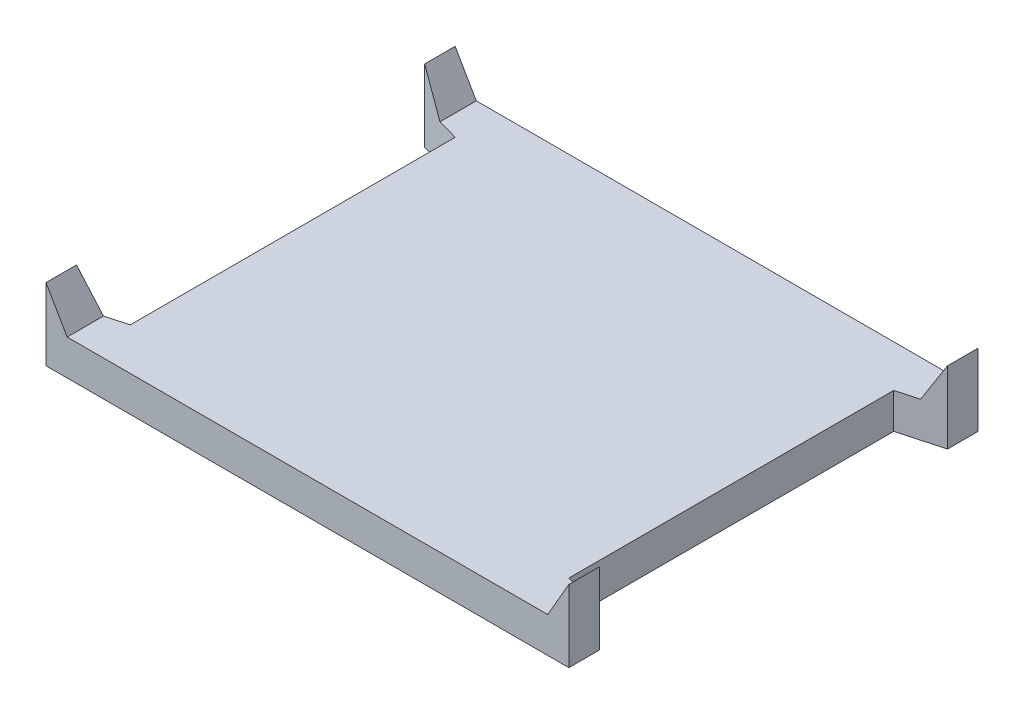
ISO-10303-21;
HEADER;
FILE_DESCRIPTION(('STEP AP214'),'2;1');
FILE_NAME('part.step','',(''),(''),'','','');
FILE_SCHEMA(('AUTOMOTIVE_DESIGN { 1 0 10303 214 1 1 1 1 }'));
ENDSEC;
DATA;
#1=APPLICATION_CONTEXT('core data for automotive mechanical design processes');
#2=APPLICATION_PROTOCOL_DEFINITION('international standard','automotive_design',2000,#1);
#3=PRODUCT_CONTEXT('',#1,'mechanical');
#4=PRODUCT('Part','Part','',(#3));
#5=PRODUCT_RELATED_PRODUCT_CATEGORY('part','',(#4));
#6=PRODUCT_DEFINITION_FORMATION('','',#4);
#7=PRODUCT_DEFINITION_CONTEXT('part definition',#1,'design');
#8=PRODUCT_DEFINITION('design','',#6,#7);
#9=PRODUCT_DEFINITION_SHAPE('','',#8);
#10=(LENGTH_UNIT() NAMED_UNIT(*) SI_UNIT(.MILLI.,.METRE.));
#11=(NAMED_UNIT(*) PLANE_ANGLE_UNIT() SI_UNIT($,.RADIAN.));
#12=(NAMED_UNIT(*) SI_UNIT($,.STERADIAN.) SOLID_ANGLE_UNIT());
#13=UNCERTAINTY_MEASURE_WITH_UNIT(LENGTH_MEASURE(1.E-05),#10,'distance_accuracy_value','');
#14=(GEOMETRIC_REPRESENTATION_CONTEXT(3) GLOBAL_UNCERTAINTY_ASSIGNED_CONTEXT((#13)) GLOBAL_UNIT_ASSIGNED_CONTEXT((#10,
#11,#12)) REPRESENTATION_CONTEXT('',''));
#15=CARTESIAN_POINT('',(0.,0.,0.));
#16=DIRECTION('',(0.,0.,1.));
#17=DIRECTION('',(1.,0.,0.));
#18=AXIS2_PLACEMENT_3D('',#15,#16,#17);
#19=CARTESIAN_POINT('',(1.118652877862,0.15,-0.5588));
#20=DIRECTION('',(0.866025403784329,-0.50000000000019,0.));
#21=DIRECTION('',(0.50000000000019,0.866025403784329,0.));
#22=AXIS2_PLACEMENT_3D('',#19,#20,#21);
#23=PLANE('',#22);
#24=DIRECTION('',(0.500000000001896,0.866025403783344,0.));
#25=VECTOR('',#24,1.);
#26=CARTESIAN_POINT('',(1.016,-0.02779999999999,-0.865));
#27=LINE('',#26,#25);
#28=CARTESIAN_POINT('',(1.01600000000001,-0.0277999999999941,-0.865));
#29=VERTEX_POINT('',#28);
#30=CARTESIAN_POINT('',(1.10537382167086,0.12700000000008,-0.865));
#31=VERTEX_POINT('',#30);
#32=EDGE_CURVE('E168',#29,#31,#27,.T.);
#33=ORIENTED_EDGE('',*,*,#32,.F.);
#34=DIRECTION('',(0.,0.,1.));
#35=VECTOR('',#34,1.);
#36=CARTESIAN_POINT('',(1.016,-0.02779999999999,0.));
#37=LINE('',#36,#35);
#38=CARTESIAN_POINT('',(1.01599999999999,-0.0277999999999983,-0.711432590348084));
#39=VERTEX_POINT('',#38);
#40=EDGE_CURVE('E20',#39,#29,#37,.F.);
#41=ORIENTED_EDGE('',*,*,#40,.F.);
#42=DIRECTION('',(-0.495345023716674,-0.857962748349385,0.136136805911909));
#43=VECTOR('',#42,1.);
#44=CARTESIAN_POINT('',(1.1053738216709,0.127,-0.735995402190348));
#45=LINE('',#44,#43);
#46=CARTESIAN_POINT('',(1.10537382167088,0.12700000000004,-0.735995402190174));
#47=VERTEX_POINT('',#46);
#48=EDGE_CURVE('E190',#47,#39,#45,.T.);
#49=ORIENTED_EDGE('',*,*,#48,.F.);
#50=DIRECTION('',(0.,0.,1.));
#51=VECTOR('',#50,1.);
#52=CARTESIAN_POINT('',(1.105373821671,0.127,0.865));
#53=LINE('',#52,#51);
#54=EDGE_CURVE('E174',#47,#31,#53,.F.);
#55=ORIENTED_EDGE('',*,*,#54,.T.);
#56=EDGE_LOOP('',(#33,#41,#49,#55));
#57=FACE_BOUND('',#56,.T.);
#58=ADVANCED_FACE('F17',(#57),#23,.F.);
#59=CARTESIAN_POINT('',(-1.118652877862,0.15,-0.5588));
#60=DIRECTION('',(0.866025403784329,0.50000000000019,0.));
#61=DIRECTION('',(-0.50000000000019,0.866025403784329,0.));
#62=AXIS2_PLACEMENT_3D('',#59,#60,#61);
#63=PLANE('',#62);
#64=DIRECTION('',(0.,0.,-1.));
#65=VECTOR('',#64,1.);
#66=CARTESIAN_POINT('',(-1.105373821671,0.127,-0.865));
#67=LINE('',#66,#65);
#68=CARTESIAN_POINT('',(-1.10537382167093,0.12700000000004,-0.865));
#69=VERTEX_POINT('',#68);
#70=CARTESIAN_POINT('',(-1.10537382167091,0.12700000000004,-0.735995402190087));
#71=VERTEX_POINT('',#70);
#72=EDGE_CURVE('E247',#69,#71,#67,.F.);
#73=ORIENTED_EDGE('',*,*,#72,.T.);
#74=DIRECTION('',(0.495345023716674,-0.857962748349385,0.136136805911909));
#75=VECTOR('',#74,1.);
#76=CARTESIAN_POINT('',(-1.1053738216709,0.127,-0.735995402190348));
#77=LINE('',#76,#75);
#78=CARTESIAN_POINT('',(-1.01599999999999,-0.0277999999999983,-0.711432590348084));
#79=VERTEX_POINT('',#78);
#80=EDGE_CURVE('E241',#71,#79,#77,.T.);
#81=ORIENTED_EDGE('',*,*,#80,.T.);
#82=DIRECTION('',(0.,0.,1.));
#83=VECTOR('',#82,1.);
#84=CARTESIAN_POINT('',(-1.016,-0.02779999999999,0.));
#85=LINE('',#84,#83);
#86=CARTESIAN_POINT('',(-1.01600000000001,-0.0277999999999983,-0.865));
#87=VERTEX_POINT('',#86);
#88=EDGE_CURVE('E155',#87,#79,#85,.T.);
#89=ORIENTED_EDGE('',*,*,#88,.F.);
#90=DIRECTION('',(0.500000000001896,-0.866025403783344,0.));
#91=VECTOR('',#90,1.);
#92=CARTESIAN_POINT('',(-1.105373821671,0.127,-0.865));
#93=LINE('',#92,#91);
#94=EDGE_CURVE('E171',#69,#87,#93,.T.);
#95=ORIENTED_EDGE('',*,*,#94,.F.);
#96=EDGE_LOOP('',(#73,#81,#89,#95));
#97=FACE_BOUND('',#96,.T.);
#98=ADVANCED_FACE('F414',(#97),#63,.T.);
#99=CARTESIAN_POINT('',(-1.118652877862,0.15,0.5588));
#100=DIRECTION('',(-0.866025403784329,-0.50000000000019,0.));
#101=DIRECTION('',(0.50000000000019,-0.866025403784329,0.));
#102=AXIS2_PLACEMENT_3D('',#99,#100,#101);
#103=PLANE('',#102);
#104=DIRECTION('',(-0.500000000001896,0.866025403783344,0.));
#105=VECTOR('',#104,1.);
#106=CARTESIAN_POINT('',(-1.016,-0.02779999999999,0.865));
#107=LINE('',#106,#105);
#108=CARTESIAN_POINT('',(-1.01600000000001,-0.0277999999999983,0.865));
#109=VERTEX_POINT('',#108);
#110=CARTESIAN_POINT('',(-1.10537382167086,0.12700000000008,0.865));
#111=VERTEX_POINT('',#110);
#112=EDGE_CURVE('E220',#109,#111,#107,.T.);
#113=ORIENTED_EDGE('',*,*,#112,.F.);
#114=DIRECTION('',(0.,0.,1.));
#115=VECTOR('',#114,1.);
#116=CARTESIAN_POINT('',(-1.016,-0.02779999999999,0.));
#117=LINE('',#116,#115);
#118=CARTESIAN_POINT('',(-1.01599999999999,-0.0277999999999983,0.711432590348084));
#119=VERTEX_POINT('',#118);
#120=EDGE_CURVE('E139',#119,#109,#117,.T.);
#121=ORIENTED_EDGE('',*,*,#120,.F.);
#122=DIRECTION('',(0.495345023716674,-0.857962748349385,-0.136136805911909));
#123=VECTOR('',#122,1.);
#124=CARTESIAN_POINT('',(-1.1053738216709,0.127,0.735995402190348));
#125=LINE('',#124,#123);
#126=CARTESIAN_POINT('',(-1.10537382167088,0.12700000000004,0.735995402190174));
#127=VERTEX_POINT('',#126);
#128=EDGE_CURVE('E232',#127,#119,#125,.T.);
#129=ORIENTED_EDGE('',*,*,#128,.F.);
#130=DIRECTION('',(0.,0.,-1.));
#131=VECTOR('',#130,1.);
#132=CARTESIAN_POINT('',(-1.105373821671,0.127,-0.865));
#133=LINE('',#132,#131);
#134=EDGE_CURVE('E222',#127,#111,#133,.F.);
#135=ORIENTED_EDGE('',*,*,#134,.T.);
#136=EDGE_LOOP('',(#113,#121,#129,#135));
#137=FACE_BOUND('',#136,.T.);
#138=ADVANCED_FACE('F406',(#137),#103,.F.);
#139=CARTESIAN_POINT('',(0.,-0.02779999999999,0.));
#140=DIRECTION('',(0.,1.,0.));
#141=DIRECTION('',(0.,0.,1.));
#142=AXIS2_PLACEMENT_3D('',#139,#140,#141);
#143=PLANE('',#142);
#144=ORIENTED_EDGE('',*,*,#120,.T.);
#145=DIRECTION('',(1.,0.,0.));
#146=VECTOR('',#145,1.);
#147=CARTESIAN_POINT('',(-0.9271,-0.02779999999999,0.865));
#148=LINE('',#147,#146);
#149=CARTESIAN_POINT('',(1.01600000000001,-0.0277999999999983,0.865));
#150=VERTEX_POINT('',#149);
#151=EDGE_CURVE('E134',#150,#109,#148,.F.);
#152=ORIENTED_EDGE('',*,*,#151,.F.);
#153=DIRECTION('',(0.,0.,1.));
#154=VECTOR('',#153,1.);
#155=CARTESIAN_POINT('',(1.01600000000003,-0.0278000000000066,0.5588));
#156=LINE('',#155,#154);
#157=CARTESIAN_POINT('',(1.01599999999999,-0.0277999999999983,0.711432590348084));
#158=VERTEX_POINT('',#157);
#159=EDGE_CURVE('E131',#158,#150,#156,.T.);
#160=ORIENTED_EDGE('',*,*,#159,.F.);
#161=DIRECTION('',(0.964246726340993,0.,0.265006133401998));
#162=VECTOR('',#161,1.);
#163=CARTESIAN_POINT('',(0.9271,-0.02779999999999,0.687));
#164=LINE('',#163,#162);
#165=CARTESIAN_POINT('',(0.9271,-0.02779999999999,0.687));
#166=VERTEX_POINT('',#165);
#167=EDGE_CURVE('E128',#158,#166,#164,.F.);
#168=ORIENTED_EDGE('',*,*,#167,.T.);
#169=DIRECTION('',(0.,0.,-1.));
#170=VECTOR('',#169,1.);
#171=CARTESIAN_POINT('',(0.9271,-0.02779999999999,0.865));
#172=LINE('',#171,#170);
#173=CARTESIAN_POINT('',(0.9271,-0.02779999999999,-0.687));
#174=VERTEX_POINT('',#173);
#175=EDGE_CURVE('E192',#174,#166,#172,.F.);
#176=ORIENTED_EDGE('',*,*,#175,.F.);
#177=DIRECTION('',(0.964246726340993,0.,-0.265006133401998));
#178=VECTOR('',#177,1.);
#179=CARTESIAN_POINT('',(0.9271,-0.02779999999999,-0.687));
#180=LINE('',#179,#178);
#181=EDGE_CURVE('E163',#39,#174,#180,.F.);
#182=ORIENTED_EDGE('',*,*,#181,.F.);
#183=ORIENTED_EDGE('',*,*,#40,.T.);
#184=DIRECTION('',(-1.,0.,0.));
#185=VECTOR('',#184,1.);
#186=CARTESIAN_POINT('',(0.9271,-0.02779999999999,-0.865));
#187=LINE('',#186,#185);
#188=EDGE_CURVE('E162',#87,#29,#187,.F.);
#189=ORIENTED_EDGE('',*,*,#188,.F.);
#190=ORIENTED_EDGE('',*,*,#88,.T.);
#191=DIRECTION('',(-0.964246726340993,0.,-0.265006133401998));
#192=VECTOR('',#191,1.);
#193=CARTESIAN_POINT('',(-0.9271,-0.02779999999999,-0.687));
#194=LINE('',#193,#192);
#195=CARTESIAN_POINT('',(-0.9271,-0.02779999999999,-0.687));
#196=VERTEX_POINT('',#195);
#197=EDGE_CURVE('E239',#79,#196,#194,.F.);
#198=ORIENTED_EDGE('',*,*,#197,.T.);
#199=DIRECTION('',(0.,0.,1.));
#200=VECTOR('',#199,1.);
#201=CARTESIAN_POINT('',(-0.9271,-0.02779999999999,-0.865));
#202=LINE('',#201,#200);
#203=CARTESIAN_POINT('',(-0.9271,-0.02779999999999,0.687));
#204=VERTEX_POINT('',#203);
#205=EDGE_CURVE('E234',#204,#196,#202,.F.);
#206=ORIENTED_EDGE('',*,*,#205,.F.);
#207=DIRECTION('',(-0.964246726340993,0.,0.265006133401998));
#208=VECTOR('',#207,1.);
#209=CARTESIAN_POINT('',(-0.9271,-0.02779999999999,0.687));
#210=LINE('',#209,#208);
#211=EDGE_CURVE('E230',#119,#204,#210,.F.);
#212=ORIENTED_EDGE('',*,*,#211,.F.);
#213=EDGE_LOOP('',(#144,#152,#160,#168,#176,#182,#183,#189,#190,#198,#206,#212));
#214=FACE_BOUND('',#213,.T.);
#215=ADVANCED_FACE('F132',(#214),#143,.T.);
#216=CARTESIAN_POINT('',(1.118652877862,0.15,0.5588));
#217=DIRECTION('',(-0.866025403784329,0.50000000000019,0.));
#218=DIRECTION('',(-0.50000000000019,-0.866025403784329,0.));
#219=AXIS2_PLACEMENT_3D('',#216,#217,#218);
#220=PLANE('',#219);
#221=DIRECTION('',(0.,0.,1.));
#222=VECTOR('',#221,1.);
#223=CARTESIAN_POINT('',(1.105373821671,0.127,0.865));
#224=LINE('',#223,#222);
#225=CARTESIAN_POINT('',(1.10537382167093,0.12700000000004,0.865));
#226=VERTEX_POINT('',#225);
#227=CARTESIAN_POINT('',(1.10537382167084,0.12700000000008,0.735995402190087));
#228=VERTEX_POINT('',#227);
#229=EDGE_CURVE('E151',#226,#228,#224,.F.);
#230=ORIENTED_EDGE('',*,*,#229,.T.);
#231=DIRECTION('',(-0.495345023716674,-0.857962748349385,-0.136136805911909));
#232=VECTOR('',#231,1.);
#233=CARTESIAN_POINT('',(1.1053738216709,0.127,0.735995402190348));
#234=LINE('',#233,#232);
#235=EDGE_CURVE('E138',#228,#158,#234,.T.);
#236=ORIENTED_EDGE('',*,*,#235,.T.);
#237=ORIENTED_EDGE('',*,*,#159,.T.);
#238=DIRECTION('',(-0.500000000001896,-0.866025403783344,0.));
#239=VECTOR('',#238,1.);
#240=CARTESIAN_POINT('',(1.105373821671,0.127,0.865));
#241=LINE('',#240,#239);
#242=EDGE_CURVE('E216',#226,#150,#241,.T.);
#243=ORIENTED_EDGE('',*,*,#242,.F.);
#244=EDGE_LOOP('',(#230,#236,#237,#243));
#245=FACE_BOUND('',#244,.T.);
#246=ADVANCED_FACE('F150',(#245),#220,.T.);
#247=CARTESIAN_POINT('',(0.9271,0.15,0.687));
#248=DIRECTION('',(-0.265006133401998,0.,0.964246726340993));
#249=DIRECTION('',(0.964246726340993,0.,0.265006133401998));
#250=AXIS2_PLACEMENT_3D('',#247,#248,#249);
#251=PLANE('',#250);
#252=ORIENTED_EDGE('',*,*,#167,.F.);
#253=ORIENTED_EDGE('',*,*,#235,.F.);
#254=DIRECTION('',(0.,1.,0.));
#255=VECTOR('',#254,1.);
#256=CARTESIAN_POINT('',(1.105373821671,-0.1778,0.73599540219));
#257=LINE('',#256,#255);
#258=CARTESIAN_POINT('',(1.10537382167095,-0.1778,0.735995402190174));
#259=VERTEX_POINT('',#258);
#260=EDGE_CURVE('E208',#228,#259,#257,.F.);
#261=ORIENTED_EDGE('',*,*,#260,.T.);
#262=DIRECTION('',(-0.964246726341511,0.,-0.265006133400114));
#263=VECTOR('',#262,1.);
#264=CARTESIAN_POINT('',(1.105373821671,-0.1778,0.73599540219));
#265=LINE('',#264,#263);
#266=CARTESIAN_POINT('',(0.9271,-0.1778,0.687));
#267=VERTEX_POINT('',#266);
#268=EDGE_CURVE('E203',#259,#267,#265,.T.);
#269=ORIENTED_EDGE('',*,*,#268,.T.);
#270=DIRECTION('',(0.,1.,0.));
#271=VECTOR('',#270,1.);
#272=CARTESIAN_POINT('',(0.9271,-0.1778,0.687));
#273=LINE('',#272,#271);
#274=EDGE_CURVE('E147',#166,#267,#273,.F.);
#275=ORIENTED_EDGE('',*,*,#274,.F.);
#276=EDGE_LOOP('',(#252,#253,#261,#269,#275));
#277=FACE_BOUND('',#276,.T.);
#278=ADVANCED_FACE('F143',(#277),#251,.F.);
#279=CARTESIAN_POINT('',(0.9271,-0.1778,0.865));
#280=DIRECTION('',(1.,0.,0.));
#281=DIRECTION('',(0.,0.,-1.));
#282=AXIS2_PLACEMENT_3D('',#279,#280,#281);
#283=PLANE('',#282);
#284=DIRECTION('',(0.,1.,0.));
#285=VECTOR('',#284,1.);
#286=CARTESIAN_POINT('',(0.9271,0.15,-0.687));
#287=LINE('',#286,#285);
#288=CARTESIAN_POINT('',(0.9271,-0.1778,-0.687));
#289=VERTEX_POINT('',#288);
#290=EDGE_CURVE('E187',#174,#289,#287,.F.);
#291=ORIENTED_EDGE('',*,*,#290,.F.);
#292=ORIENTED_EDGE('',*,*,#175,.T.);
#293=ORIENTED_EDGE('',*,*,#274,.T.);
#294=DIRECTION('',(0.,0.,1.));
#295=VECTOR('',#294,1.);
#296=CARTESIAN_POINT('',(0.9271,-0.1778,0.));
#297=LINE('',#296,#295);
#298=EDGE_CURVE('E198',#267,#289,#297,.F.);
#299=ORIENTED_EDGE('',*,*,#298,.T.);
#300=EDGE_LOOP('',(#291,#292,#293,#299));
#301=FACE_BOUND('',#300,.T.);
#302=ADVANCED_FACE('F197',(#301),#283,.T.);
#303=CARTESIAN_POINT('',(0.9271,0.15,-0.687));
#304=DIRECTION('',(0.265006133401998,0.,0.964246726340993));
#305=DIRECTION('',(0.964246726340993,0.,-0.265006133401998));
#306=AXIS2_PLACEMENT_3D('',#303,#304,#305);
#307=PLANE('',#306);
#308=ORIENTED_EDGE('',*,*,#290,.T.);
#309=DIRECTION('',(0.964246726341511,0.,-0.265006133400114));
#310=VECTOR('',#309,1.);
#311=CARTESIAN_POINT('',(0.9271,-0.1778,-0.687));
#312=LINE('',#311,#310);
#313=CARTESIAN_POINT('',(1.10537382167095,-0.1778,-0.735995402190174));
#314=VERTEX_POINT('',#313);
#315=EDGE_CURVE('E206',#289,#314,#312,.T.);
#316=ORIENTED_EDGE('',*,*,#315,.T.);
#317=DIRECTION('',(0.,1.,0.));
#318=VECTOR('',#317,1.);
#319=CARTESIAN_POINT('',(1.105373821671,-0.1778,-0.73599540219));
#320=LINE('',#319,#318);
#321=EDGE_CURVE('E184',#314,#47,#320,.T.);
#322=ORIENTED_EDGE('',*,*,#321,.T.);
#323=ORIENTED_EDGE('',*,*,#48,.T.);
#324=ORIENTED_EDGE('',*,*,#181,.T.);
#325=EDGE_LOOP('',(#308,#316,#322,#323,#324));
#326=FACE_BOUND('',#325,.T.);
#327=ADVANCED_FACE('F270',(#326),#307,.T.);
#328=CARTESIAN_POINT('',(1.105373821671,-0.1778,0.865));
#329=DIRECTION('',(-1.,0.,0.));
#330=DIRECTION('',(0.,0.,1.));
#331=AXIS2_PLACEMENT_3D('',#328,#329,#330);
#332=PLANE('',#331);
#333=ORIENTED_EDGE('',*,*,#54,.F.);
#334=ORIENTED_EDGE('',*,*,#321,.F.);
#335=DIRECTION('',(0.,0.,1.));
#336=VECTOR('',#335,1.);
#337=CARTESIAN_POINT('',(1.105373821671,-0.1778,0.));
#338=LINE('',#337,#336);
#339=CARTESIAN_POINT('',(1.105373821671,-0.1778,-0.865));
#340=VERTEX_POINT('',#339);
#341=EDGE_CURVE('E265',#314,#340,#338,.F.);
#342=ORIENTED_EDGE('',*,*,#341,.T.);
#343=DIRECTION('',(0.,1.,0.));
#344=VECTOR('',#343,1.);
#345=CARTESIAN_POINT('',(1.105373821671,-0.1778,-0.865));
#346=LINE('',#345,#344);
#347=EDGE_CURVE('E176',#31,#340,#346,.F.);
#348=ORIENTED_EDGE('',*,*,#347,.F.);
#349=EDGE_LOOP('',(#333,#334,#342,#348));
#350=FACE_BOUND('',#349,.T.);
#351=ADVANCED_FACE('F272',(#350),#332,.F.);
#352=CARTESIAN_POINT('',(0.9271,-0.1778,-0.865));
#353=DIRECTION('',(0.,0.,-1.));
#354=DIRECTION('',(-1.,0.,0.));
#355=AXIS2_PLACEMENT_3D('',#352,#353,#354);
#356=PLANE('',#355);
#357=ORIENTED_EDGE('',*,*,#347,.T.);
#358=DIRECTION('',(1.,0.,0.));
#359=VECTOR('',#358,1.);
#360=CARTESIAN_POINT('',(0.,-0.1778,-0.865));
#361=LINE('',#360,#359);
#362=CARTESIAN_POINT('',(-1.105373821671,-0.1778,-0.865));
#363=VERTEX_POINT('',#362);
#364=EDGE_CURVE('E250',#340,#363,#361,.F.);
#365=ORIENTED_EDGE('',*,*,#364,.T.);
#366=DIRECTION('',(0.,1.,0.));
#367=VECTOR('',#366,1.);
#368=CARTESIAN_POINT('',(-1.105373821671,-0.1778,-0.865));
#369=LINE('',#368,#367);
#370=EDGE_CURVE('E178',#363,#69,#369,.T.);
#371=ORIENTED_EDGE('',*,*,#370,.T.);
#372=ORIENTED_EDGE('',*,*,#94,.T.);
#373=ORIENTED_EDGE('',*,*,#188,.T.);
#374=ORIENTED_EDGE('',*,*,#32,.T.);
#375=EDGE_LOOP('',(#357,#365,#371,#372,#373,#374));
#376=FACE_BOUND('',#375,.T.);
#377=ADVANCED_FACE('F167',(#376),#356,.T.);
#378=CARTESIAN_POINT('',(-1.105373821671,-0.1778,-0.865));
#379=DIRECTION('',(1.,0.,0.));
#380=DIRECTION('',(0.,0.,-1.));
#381=AXIS2_PLACEMENT_3D('',#378,#379,#380);
#382=PLANE('',#381);
#383=ORIENTED_EDGE('',*,*,#72,.F.);
#384=ORIENTED_EDGE('',*,*,#370,.F.);
#385=DIRECTION('',(0.,0.,1.));
#386=VECTOR('',#385,1.);
#387=CARTESIAN_POINT('',(-1.105373821671,-0.1778,0.));
#388=LINE('',#387,#386);
#389=CARTESIAN_POINT('',(-1.10537382167098,-0.1778,-0.735995402190087));
#390=VERTEX_POINT('',#389);
#391=EDGE_CURVE('E256',#363,#390,#388,.T.);
#392=ORIENTED_EDGE('',*,*,#391,.T.);
#393=DIRECTION('',(0.,1.,0.));
#394=VECTOR('',#393,1.);
#395=CARTESIAN_POINT('',(-1.1053738216709,0.15,-0.735995402190348));
#396=LINE('',#395,#394);
#397=EDGE_CURVE('E244',#390,#71,#396,.T.);
#398=ORIENTED_EDGE('',*,*,#397,.T.);
#399=EDGE_LOOP('',(#383,#384,#392,#398));
#400=FACE_BOUND('',#399,.T.);
#401=ADVANCED_FACE('F255',(#400),#382,.F.);
#402=CARTESIAN_POINT('',(-0.9271,0.15,-0.687));
#403=DIRECTION('',(0.265006133401998,0.,-0.964246726340993));
#404=DIRECTION('',(-0.964246726340993,0.,-0.265006133401998));
#405=AXIS2_PLACEMENT_3D('',#402,#403,#404);
#406=PLANE('',#405);
#407=ORIENTED_EDGE('',*,*,#197,.F.);
#408=ORIENTED_EDGE('',*,*,#80,.F.);
#409=ORIENTED_EDGE('',*,*,#397,.F.);
#410=DIRECTION('',(0.964246726341511,0.,0.265006133400114));
#411=VECTOR('',#410,1.);
#412=CARTESIAN_POINT('',(-1.105373821671,-0.1778,-0.73599540219));
#413=LINE('',#412,#411);
#414=CARTESIAN_POINT('',(-0.9271,-0.1778,-0.687));
#415=VERTEX_POINT('',#414);
#416=EDGE_CURVE('E261',#390,#415,#413,.T.);
#417=ORIENTED_EDGE('',*,*,#416,.T.);
#418=DIRECTION('',(0.,1.,0.));
#419=VECTOR('',#418,1.);
#420=CARTESIAN_POINT('',(-0.9271,-0.1778,-0.687));
#421=LINE('',#420,#419);
#422=EDGE_CURVE('E237',#196,#415,#421,.F.);
#423=ORIENTED_EDGE('',*,*,#422,.F.);
#424=EDGE_LOOP('',(#407,#408,#409,#417,#423));
#425=FACE_BOUND('',#424,.T.);
#426=ADVANCED_FACE('F305',(#425),#406,.F.);
#427=CARTESIAN_POINT('',(-0.9271,-0.1778,-0.865));
#428=DIRECTION('',(-1.,0.,0.));
#429=DIRECTION('',(0.,0.,1.));
#430=AXIS2_PLACEMENT_3D('',#427,#428,#429);
#431=PLANE('',#430);
#432=DIRECTION('',(0.,1.,0.));
#433=VECTOR('',#432,1.);
#434=CARTESIAN_POINT('',(-0.9271,0.15,0.687));
#435=LINE('',#434,#433);
#436=CARTESIAN_POINT('',(-0.9271,-0.1778,0.687));
#437=VERTEX_POINT('',#436);
#438=EDGE_CURVE('E228',#204,#437,#435,.F.);
#439=ORIENTED_EDGE('',*,*,#438,.F.);
#440=ORIENTED_EDGE('',*,*,#205,.T.);
#441=ORIENTED_EDGE('',*,*,#422,.T.);
#442=DIRECTION('',(0.,0.,1.));
#443=VECTOR('',#442,1.);
#444=CARTESIAN_POINT('',(-0.9271,-0.1778,0.));
#445=LINE('',#444,#443);
#446=EDGE_CURVE('E263',#415,#437,#445,.T.);
#447=ORIENTED_EDGE('',*,*,#446,.T.);
#448=EDGE_LOOP('',(#439,#440,#441,#447));
#449=FACE_BOUND('',#448,.T.);
#450=ADVANCED_FACE('F301',(#449),#431,.T.);
#451=CARTESIAN_POINT('',(-0.9271,0.15,0.687));
#452=DIRECTION('',(-0.265006133401998,0.,-0.964246726340993));
#453=DIRECTION('',(-0.964246726340993,0.,0.265006133401998));
#454=AXIS2_PLACEMENT_3D('',#451,#452,#453);
#455=PLANE('',#454);
#456=ORIENTED_EDGE('',*,*,#438,.T.);
#457=DIRECTION('',(-0.964246726341511,0.,0.265006133400114));
#458=VECTOR('',#457,1.);
#459=CARTESIAN_POINT('',(-0.9271,-0.1778,0.687));
#460=LINE('',#459,#458);
#461=CARTESIAN_POINT('',(-1.10537382167095,-0.1778,0.735995402190174));
#462=VERTEX_POINT('',#461);
#463=EDGE_CURVE('E446',#437,#462,#460,.T.);
#464=ORIENTED_EDGE('',*,*,#463,.T.);
#465=DIRECTION('',(0.,1.,0.));
#466=VECTOR('',#465,1.);
#467=CARTESIAN_POINT('',(-1.105373821671,-0.1778,0.73599540219));
#468=LINE('',#467,#466);
#469=EDGE_CURVE('E225',#462,#127,#468,.T.);
#470=ORIENTED_EDGE('',*,*,#469,.T.);
#471=ORIENTED_EDGE('',*,*,#128,.T.);
#472=ORIENTED_EDGE('',*,*,#211,.T.);
#473=EDGE_LOOP('',(#456,#464,#470,#471,#472));
#474=FACE_BOUND('',#473,.T.);
#475=ADVANCED_FACE('F297',(#474),#455,.T.);
#476=CARTESIAN_POINT('',(-1.105373821671,-0.1778,-0.865));
#477=DIRECTION('',(1.,0.,0.));
#478=DIRECTION('',(0.,0.,-1.));
#479=AXIS2_PLACEMENT_3D('',#476,#477,#478);
#480=PLANE('',#479);
#481=ORIENTED_EDGE('',*,*,#134,.F.);
#482=ORIENTED_EDGE('',*,*,#469,.F.);
#483=DIRECTION('',(0.,0.,1.));
#484=VECTOR('',#483,1.);
#485=CARTESIAN_POINT('',(-1.105373821671,-0.1778,0.));
#486=LINE('',#485,#484);
#487=CARTESIAN_POINT('',(-1.105373821671,-0.1778,0.865));
#488=VERTEX_POINT('',#487);
#489=EDGE_CURVE('E449',#462,#488,#486,.T.);
#490=ORIENTED_EDGE('',*,*,#489,.T.);
#491=DIRECTION('',(0.,1.,0.));
#492=VECTOR('',#491,1.);
#493=CARTESIAN_POINT('',(-1.105373821671,-0.1778,0.865));
#494=LINE('',#493,#492);
#495=EDGE_CURVE('E218',#111,#488,#494,.F.);
#496=ORIENTED_EDGE('',*,*,#495,.F.);
#497=EDGE_LOOP('',(#481,#482,#490,#496));
#498=FACE_BOUND('',#497,.T.);
#499=ADVANCED_FACE('F293',(#498),#480,.F.);
#500=CARTESIAN_POINT('',(-0.9271,-0.1778,0.865));
#501=DIRECTION('',(0.,0.,1.));
#502=DIRECTION('',(1.,0.,0.));
#503=AXIS2_PLACEMENT_3D('',#500,#501,#502);
#504=PLANE('',#503);
#505=ORIENTED_EDGE('',*,*,#242,.T.);
#506=ORIENTED_EDGE('',*,*,#151,.T.);
#507=ORIENTED_EDGE('',*,*,#112,.T.);
#508=ORIENTED_EDGE('',*,*,#495,.T.);
#509=DIRECTION('',(1.,0.,0.));
#510=VECTOR('',#509,1.);
#511=CARTESIAN_POINT('',(0.,-0.1778,0.865));
#512=LINE('',#511,#510);
#513=CARTESIAN_POINT('',(1.105373821671,-0.1778,0.865));
#514=VERTEX_POINT('',#513);
#515=EDGE_CURVE('E26',#488,#514,#512,.T.);
#516=ORIENTED_EDGE('',*,*,#515,.T.);
#517=DIRECTION('',(0.,1.,0.));
#518=VECTOR('',#517,1.);
#519=CARTESIAN_POINT('',(1.105373821671,-0.1778,0.865));
#520=LINE('',#519,#518);
#521=EDGE_CURVE('E34',#514,#226,#520,.T.);
#522=ORIENTED_EDGE('',*,*,#521,.T.);
#523=EDGE_LOOP('',(#505,#506,#507,#508,#516,#522));
#524=FACE_BOUND('',#523,.T.);
#525=ADVANCED_FACE('F288',(#524),#504,.T.);
#526=CARTESIAN_POINT('',(1.105373821671,-0.1778,0.865));
#527=DIRECTION('',(-1.,0.,0.));
#528=DIRECTION('',(0.,0.,1.));
#529=AXIS2_PLACEMENT_3D('',#526,#527,#528);
#530=PLANE('',#529);
#531=ORIENTED_EDGE('',*,*,#229,.F.);
#532=ORIENTED_EDGE('',*,*,#521,.F.);
#533=DIRECTION('',(0.,0.,1.));
#534=VECTOR('',#533,1.);
#535=CARTESIAN_POINT('',(1.105373821671,-0.1778,0.));
#536=LINE('',#535,#534);
#537=EDGE_CURVE('E11',#514,#259,#536,.F.);
#538=ORIENTED_EDGE('',*,*,#537,.T.);
#539=ORIENTED_EDGE('',*,*,#260,.F.);
#540=EDGE_LOOP('',(#531,#532,#538,#539));
#541=FACE_BOUND('',#540,.T.);
#542=ADVANCED_FACE('F283',(#541),#530,.F.);
#543=CARTESIAN_POINT('',(0.,-0.1778,0.));
#544=DIRECTION('',(0.,1.,0.));
#545=DIRECTION('',(0.,0.,1.));
#546=AXIS2_PLACEMENT_3D('',#543,#544,#545);
#547=PLANE('',#546);
#548=ORIENTED_EDGE('',*,*,#515,.F.);
#549=ORIENTED_EDGE('',*,*,#489,.F.);
#550=ORIENTED_EDGE('',*,*,#463,.F.);
#551=ORIENTED_EDGE('',*,*,#446,.F.);
#552=ORIENTED_EDGE('',*,*,#416,.F.);
#553=ORIENTED_EDGE('',*,*,#391,.F.);
#554=ORIENTED_EDGE('',*,*,#364,.F.);
#555=ORIENTED_EDGE('',*,*,#341,.F.);
#556=ORIENTED_EDGE('',*,*,#315,.F.);
#557=ORIENTED_EDGE('',*,*,#298,.F.);
#558=ORIENTED_EDGE('',*,*,#268,.F.);
#559=ORIENTED_EDGE('',*,*,#537,.F.);
#560=EDGE_LOOP('',(#548,#549,#550,#551,#552,#553,#554,#555,#556,#557,#558,#559));
#561=FACE_BOUND('',#560,.T.);
#562=ADVANCED_FACE('F202',(#561),#547,.F.);
#563=CLOSED_SHELL('',(#58,#98,#138,#215,#246,#278,#302,#327,#351,#377,#401,#426,#450,#475,#499,
#525,#542,#562));
#564=MANIFOLD_SOLID_BREP('B1',#563);
#565=ADVANCED_BREP_SHAPE_REPRESENTATION('',(#18,#564),#14);
#566=SHAPE_DEFINITION_REPRESENTATION(#9,#565);
ENDSEC;
END-ISO-10303-21;
